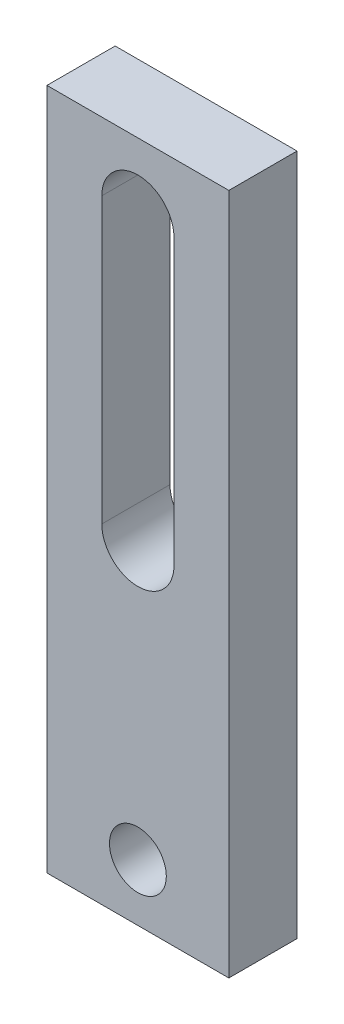
ISO-10303-21;
HEADER;
FILE_DESCRIPTION(('STEP AP214'),'2;1');
FILE_NAME('part.step','',(''),(''),'','','');
FILE_SCHEMA(('AUTOMOTIVE_DESIGN { 1 0 10303 214 1 1 1 1 }'));
ENDSEC;
DATA;
#1=APPLICATION_CONTEXT('core data for automotive mechanical design processes');
#2=APPLICATION_PROTOCOL_DEFINITION('international standard','automotive_design',2000,#1);
#3=PRODUCT_CONTEXT('',#1,'mechanical');
#4=PRODUCT('Part','Part','',(#3));
#5=PRODUCT_RELATED_PRODUCT_CATEGORY('part','',(#4));
#6=PRODUCT_DEFINITION_FORMATION('','',#4);
#7=PRODUCT_DEFINITION_CONTEXT('part definition',#1,'design');
#8=PRODUCT_DEFINITION('design','',#6,#7);
#9=PRODUCT_DEFINITION_SHAPE('','',#8);
#10=(LENGTH_UNIT() NAMED_UNIT(*) SI_UNIT(.MILLI.,.METRE.));
#11=(NAMED_UNIT(*) PLANE_ANGLE_UNIT() SI_UNIT($,.RADIAN.));
#12=(NAMED_UNIT(*) SI_UNIT($,.STERADIAN.) SOLID_ANGLE_UNIT());
#13=UNCERTAINTY_MEASURE_WITH_UNIT(LENGTH_MEASURE(1.E-05),#10,'distance_accuracy_value','');
#14=(GEOMETRIC_REPRESENTATION_CONTEXT(3) GLOBAL_UNCERTAINTY_ASSIGNED_CONTEXT((#13)) GLOBAL_UNIT_ASSIGNED_CONTEXT((#10,
#11,#12)) REPRESENTATION_CONTEXT('',''));
#15=CARTESIAN_POINT('',(0.,0.,0.));
#16=DIRECTION('',(0.,0.,1.));
#17=DIRECTION('',(1.,0.,0.));
#18=AXIS2_PLACEMENT_3D('',#15,#16,#17);
#19=CARTESIAN_POINT('',(-22.1170040672953,0.,3.));
#20=DIRECTION('',(1.,0.,0.));
#21=DIRECTION('',(0.,0.,-1.));
#22=AXIS2_PLACEMENT_3D('',#19,#20,#21);
#23=PLANE('',#22);
#24=DIRECTION('',(0.,-1.,0.));
#25=VECTOR('',#24,1.);
#26=CARTESIAN_POINT('',(-22.1170040672953,0.,0.));
#27=LINE('',#26,#25);
#28=CARTESIAN_POINT('',(-22.1170040672953,30.,0.));
#29=VERTEX_POINT('',#28);
#30=CARTESIAN_POINT('',(-22.1170040672953,0.,0.));
#31=VERTEX_POINT('',#30);
#32=EDGE_CURVE('E137',#29,#31,#27,.T.);
#33=ORIENTED_EDGE('',*,*,#32,.T.);
#34=DIRECTION('',(0.,0.,-1.));
#35=VECTOR('',#34,1.);
#36=CARTESIAN_POINT('',(-22.1170040672953,0.,3.));
#37=LINE('',#36,#35);
#38=CARTESIAN_POINT('',(-22.1170040672953,0.,3.));
#39=VERTEX_POINT('',#38);
#40=EDGE_CURVE('E11',#39,#31,#37,.T.);
#41=ORIENTED_EDGE('',*,*,#40,.F.);
#42=DIRECTION('',(0.,-1.,0.));
#43=VECTOR('',#42,1.);
#44=CARTESIAN_POINT('',(-22.1170040672953,0.,3.));
#45=LINE('',#44,#43);
#46=CARTESIAN_POINT('',(-22.1170040672953,30.,3.));
#47=VERTEX_POINT('',#46);
#48=EDGE_CURVE('E140',#47,#39,#45,.T.);
#49=ORIENTED_EDGE('',*,*,#48,.F.);
#50=DIRECTION('',(0.,0.,-1.));
#51=VECTOR('',#50,1.);
#52=CARTESIAN_POINT('',(-22.1170040672953,30.,3.));
#53=LINE('',#52,#51);
#54=EDGE_CURVE('E150',#47,#29,#53,.T.);
#55=ORIENTED_EDGE('',*,*,#54,.T.);
#56=EDGE_LOOP('',(#33,#41,#49,#55));
#57=FACE_BOUND('',#56,.T.);
#58=ADVANCED_FACE('F33',(#57),#23,.F.);
#59=CARTESIAN_POINT('',(-22.1170040672953,0.,3.));
#60=DIRECTION('',(0.,1.,0.));
#61=DIRECTION('',(0.,0.,1.));
#62=AXIS2_PLACEMENT_3D('',#59,#60,#61);
#63=PLANE('',#62);
#64=DIRECTION('',(1.,0.,0.));
#65=VECTOR('',#64,1.);
#66=CARTESIAN_POINT('',(-22.1170040672953,0.,0.));
#67=LINE('',#66,#65);
#68=CARTESIAN_POINT('',(-14.1170040672953,0.,0.));
#69=VERTEX_POINT('',#68);
#70=EDGE_CURVE('E153',#31,#69,#67,.T.);
#71=ORIENTED_EDGE('',*,*,#70,.T.);
#72=DIRECTION('',(0.,0.,-1.));
#73=VECTOR('',#72,1.);
#74=CARTESIAN_POINT('',(-14.1170040672953,0.,3.));
#75=LINE('',#74,#73);
#76=CARTESIAN_POINT('',(-14.1170040672953,0.,3.));
#77=VERTEX_POINT('',#76);
#78=EDGE_CURVE('E40',#77,#69,#75,.T.);
#79=ORIENTED_EDGE('',*,*,#78,.F.);
#80=DIRECTION('',(1.,0.,0.));
#81=VECTOR('',#80,1.);
#82=CARTESIAN_POINT('',(-22.1170040672953,0.,3.));
#83=LINE('',#82,#81);
#84=EDGE_CURVE('E143',#39,#77,#83,.T.);
#85=ORIENTED_EDGE('',*,*,#84,.F.);
#86=ORIENTED_EDGE('',*,*,#40,.T.);
#87=EDGE_LOOP('',(#71,#79,#85,#86));
#88=FACE_BOUND('',#87,.T.);
#89=ADVANCED_FACE('F182',(#88),#63,.F.);
#90=CARTESIAN_POINT('',(-14.1170040672953,0.,3.));
#91=DIRECTION('',(-1.,0.,0.));
#92=DIRECTION('',(0.,0.,1.));
#93=AXIS2_PLACEMENT_3D('',#90,#91,#92);
#94=PLANE('',#93);
#95=DIRECTION('',(0.,1.,0.));
#96=VECTOR('',#95,1.);
#97=CARTESIAN_POINT('',(-14.1170040672953,0.,0.));
#98=LINE('',#97,#96);
#99=CARTESIAN_POINT('',(-14.1170040672953,30.,0.));
#100=VERTEX_POINT('',#99);
#101=EDGE_CURVE('E155',#69,#100,#98,.T.);
#102=ORIENTED_EDGE('',*,*,#101,.T.);
#103=DIRECTION('',(0.,0.,-1.));
#104=VECTOR('',#103,1.);
#105=CARTESIAN_POINT('',(-14.1170040672953,30.,3.));
#106=LINE('',#105,#104);
#107=CARTESIAN_POINT('',(-14.1170040672953,30.,3.));
#108=VERTEX_POINT('',#107);
#109=EDGE_CURVE('E160',#108,#100,#106,.T.);
#110=ORIENTED_EDGE('',*,*,#109,.F.);
#111=DIRECTION('',(0.,1.,0.));
#112=VECTOR('',#111,1.);
#113=CARTESIAN_POINT('',(-14.1170040672953,0.,3.));
#114=LINE('',#113,#112);
#115=EDGE_CURVE('E146',#77,#108,#114,.T.);
#116=ORIENTED_EDGE('',*,*,#115,.F.);
#117=ORIENTED_EDGE('',*,*,#78,.T.);
#118=EDGE_LOOP('',(#102,#110,#116,#117));
#119=FACE_BOUND('',#118,.T.);
#120=ADVANCED_FACE('F167',(#119),#94,.F.);
#121=CARTESIAN_POINT('',(-22.1170040672953,30.,3.));
#122=DIRECTION('',(0.,-1.,0.));
#123=DIRECTION('',(0.,0.,-1.));
#124=AXIS2_PLACEMENT_3D('',#121,#122,#123);
#125=PLANE('',#124);
#126=DIRECTION('',(-1.,0.,0.));
#127=VECTOR('',#126,1.);
#128=CARTESIAN_POINT('',(-22.1170040672953,30.,0.));
#129=LINE('',#128,#127);
#130=EDGE_CURVE('E144',#100,#29,#129,.T.);
#131=ORIENTED_EDGE('',*,*,#130,.T.);
#132=ORIENTED_EDGE('',*,*,#54,.F.);
#133=DIRECTION('',(-1.,0.,0.));
#134=VECTOR('',#133,1.);
#135=CARTESIAN_POINT('',(-22.1170040672953,30.,3.));
#136=LINE('',#135,#134);
#137=EDGE_CURVE('E148',#108,#47,#136,.T.);
#138=ORIENTED_EDGE('',*,*,#137,.F.);
#139=ORIENTED_EDGE('',*,*,#109,.T.);
#140=EDGE_LOOP('',(#131,#132,#138,#139));
#141=FACE_BOUND('',#140,.T.);
#142=ADVANCED_FACE('F175',(#141),#125,.F.);
#143=CARTESIAN_POINT('',(0.,0.,3.));
#144=DIRECTION('',(0.,0.,-1.));
#145=DIRECTION('',(-1.,0.,0.));
#146=AXIS2_PLACEMENT_3D('',#143,#144,#145);
#147=PLANE('',#146);
#148=DIRECTION('',(0.,-1.,0.));
#149=VECTOR('',#148,1.);
#150=CARTESIAN_POINT('',(-19.7045040672953,27.,3.));
#151=LINE('',#150,#149);
#152=CARTESIAN_POINT('',(-19.7045040672953,27.,3.));
#153=VERTEX_POINT('',#152);
#154=CARTESIAN_POINT('',(-19.7045040672953,14.5,3.));
#155=VERTEX_POINT('',#154);
#156=EDGE_CURVE('E124',#153,#155,#151,.T.);
#157=ORIENTED_EDGE('',*,*,#156,.F.);
#158=CARTESIAN_POINT('',(-18.1170040672953,27.,3.));
#159=DIRECTION('',(0.,0.,1.));
#160=DIRECTION('',(-1.,0.,0.));
#161=AXIS2_PLACEMENT_3D('',#158,#159,#160);
#162=CIRCLE('',#161,1.5875);
#163=CARTESIAN_POINT('',(-16.5295040672953,27.,3.));
#164=VERTEX_POINT('',#163);
#165=EDGE_CURVE('E47',#164,#153,#162,.T.);
#166=ORIENTED_EDGE('',*,*,#165,.F.);
#167=DIRECTION('',(0.,1.,0.));
#168=VECTOR('',#167,1.);
#169=CARTESIAN_POINT('',(-16.5295040672953,27.,3.));
#170=LINE('',#169,#168);
#171=CARTESIAN_POINT('',(-16.5295040672953,14.5,3.));
#172=VERTEX_POINT('',#171);
#173=EDGE_CURVE('E115',#172,#164,#170,.T.);
#174=ORIENTED_EDGE('',*,*,#173,.F.);
#175=CARTESIAN_POINT('',(-18.1170040672953,14.5,3.));
#176=DIRECTION('',(0.,0.,1.));
#177=DIRECTION('',(1.,0.,0.));
#178=AXIS2_PLACEMENT_3D('',#175,#176,#177);
#179=CIRCLE('',#178,1.5875);
#180=EDGE_CURVE('E118',#155,#172,#179,.T.);
#181=ORIENTED_EDGE('',*,*,#180,.F.);
#182=EDGE_LOOP('',(#157,#166,#174,#181));
#183=FACE_BOUND('',#182,.T.);
#184=CARTESIAN_POINT('',(-18.1170040672953,2.5,3.));
#185=DIRECTION('',(0.,0.,1.));
#186=DIRECTION('',(1.,0.,0.));
#187=AXIS2_PLACEMENT_3D('',#184,#185,#186);
#188=CIRCLE('',#187,1.25);
#189=CARTESIAN_POINT('',(-16.8670040672953,2.5,3.));
#190=VERTEX_POINT('',#189);
#191=EDGE_CURVE('E130',#190,#190,#188,.T.);
#192=ORIENTED_EDGE('',*,*,#191,.F.);
#193=EDGE_LOOP('',(#192));
#194=FACE_BOUND('',#193,.T.);
#195=ORIENTED_EDGE('',*,*,#48,.T.);
#196=ORIENTED_EDGE('',*,*,#84,.T.);
#197=ORIENTED_EDGE('',*,*,#115,.T.);
#198=ORIENTED_EDGE('',*,*,#137,.T.);
#199=EDGE_LOOP('',(#195,#196,#197,#198));
#200=FACE_BOUND('',#199,.T.);
#201=ADVANCED_FACE('F181',(#183,#194,#200),#147,.F.);
#202=CARTESIAN_POINT('',(0.,0.,0.));
#203=DIRECTION('',(0.,0.,-1.));
#204=DIRECTION('',(-1.,0.,0.));
#205=AXIS2_PLACEMENT_3D('',#202,#203,#204);
#206=PLANE('',#205);
#207=CARTESIAN_POINT('',(-18.1170040672953,27.,0.));
#208=DIRECTION('',(0.,0.,1.));
#209=DIRECTION('',(-1.,0.,0.));
#210=AXIS2_PLACEMENT_3D('',#207,#208,#209);
#211=CIRCLE('',#210,1.5875);
#212=CARTESIAN_POINT('',(-16.5295040672953,27.,0.));
#213=VERTEX_POINT('',#212);
#214=CARTESIAN_POINT('',(-19.7045040672953,27.,0.));
#215=VERTEX_POINT('',#214);
#216=EDGE_CURVE('E99',#213,#215,#211,.T.);
#217=ORIENTED_EDGE('',*,*,#216,.T.);
#218=DIRECTION('',(0.,-1.,0.));
#219=VECTOR('',#218,1.);
#220=CARTESIAN_POINT('',(-19.7045040672953,27.,0.));
#221=LINE('',#220,#219);
#222=CARTESIAN_POINT('',(-19.7045040672953,14.5,0.));
#223=VERTEX_POINT('',#222);
#224=EDGE_CURVE('E108',#215,#223,#221,.T.);
#225=ORIENTED_EDGE('',*,*,#224,.T.);
#226=CARTESIAN_POINT('',(-18.1170040672953,14.5,0.));
#227=DIRECTION('',(0.,0.,1.));
#228=DIRECTION('',(1.,0.,0.));
#229=AXIS2_PLACEMENT_3D('',#226,#227,#228);
#230=CIRCLE('',#229,1.5875);
#231=CARTESIAN_POINT('',(-16.5295040672953,14.5,0.));
#232=VERTEX_POINT('',#231);
#233=EDGE_CURVE('E55',#223,#232,#230,.T.);
#234=ORIENTED_EDGE('',*,*,#233,.T.);
#235=DIRECTION('',(0.,1.,0.));
#236=VECTOR('',#235,1.);
#237=CARTESIAN_POINT('',(-16.5295040672953,27.,0.));
#238=LINE('',#237,#236);
#239=EDGE_CURVE('E105',#232,#213,#238,.T.);
#240=ORIENTED_EDGE('',*,*,#239,.T.);
#241=EDGE_LOOP('',(#217,#225,#234,#240));
#242=FACE_BOUND('',#241,.T.);
#243=CARTESIAN_POINT('',(-18.1170040672953,2.5,0.));
#244=DIRECTION('',(0.,0.,1.));
#245=DIRECTION('',(1.,0.,0.));
#246=AXIS2_PLACEMENT_3D('',#243,#244,#245);
#247=CIRCLE('',#246,1.25);
#248=CARTESIAN_POINT('',(-16.8670040672953,2.5,0.));
#249=VERTEX_POINT('',#248);
#250=EDGE_CURVE('E134',#249,#249,#247,.T.);
#251=ORIENTED_EDGE('',*,*,#250,.T.);
#252=EDGE_LOOP('',(#251));
#253=FACE_BOUND('',#252,.T.);
#254=ORIENTED_EDGE('',*,*,#32,.F.);
#255=ORIENTED_EDGE('',*,*,#130,.F.);
#256=ORIENTED_EDGE('',*,*,#101,.F.);
#257=ORIENTED_EDGE('',*,*,#70,.F.);
#258=EDGE_LOOP('',(#254,#255,#256,#257));
#259=FACE_BOUND('',#258,.T.);
#260=ADVANCED_FACE('F112',(#242,#253,#259),#206,.T.);
#261=CARTESIAN_POINT('',(-18.1170040672953,2.5,0.));
#262=DIRECTION('',(0.,0.,1.));
#263=DIRECTION('',(1.,0.,0.));
#264=AXIS2_PLACEMENT_3D('',#261,#262,#263);
#265=CYLINDRICAL_SURFACE('',#264,1.25);
#266=ORIENTED_EDGE('',*,*,#250,.F.);
#267=EDGE_LOOP('',(#266));
#268=FACE_BOUND('',#267,.T.);
#269=ORIENTED_EDGE('',*,*,#191,.T.);
#270=EDGE_LOOP('',(#269));
#271=FACE_BOUND('',#270,.T.);
#272=ADVANCED_FACE('F194',(#268,#271),#265,.F.);
#273=CARTESIAN_POINT('',(-18.1170040672953,27.,0.));
#274=DIRECTION('',(0.,0.,1.));
#275=DIRECTION('',(1.,0.,0.));
#276=AXIS2_PLACEMENT_3D('',#273,#274,#275);
#277=CYLINDRICAL_SURFACE('',#276,1.5875);
#278=ORIENTED_EDGE('',*,*,#165,.T.);
#279=DIRECTION('',(0.,0.,1.));
#280=VECTOR('',#279,1.);
#281=CARTESIAN_POINT('',(-19.7045040672953,27.,0.));
#282=LINE('',#281,#280);
#283=EDGE_CURVE('E95',#215,#153,#282,.T.);
#284=ORIENTED_EDGE('',*,*,#283,.F.);
#285=ORIENTED_EDGE('',*,*,#216,.F.);
#286=DIRECTION('',(0.,0.,1.));
#287=VECTOR('',#286,1.);
#288=CARTESIAN_POINT('',(-16.5295040672953,27.,0.));
#289=LINE('',#288,#287);
#290=EDGE_CURVE('E128',#213,#164,#289,.T.);
#291=ORIENTED_EDGE('',*,*,#290,.T.);
#292=EDGE_LOOP('',(#278,#284,#285,#291));
#293=FACE_BOUND('',#292,.T.);
#294=ADVANCED_FACE('F97',(#293),#277,.F.);
#295=CARTESIAN_POINT('',(-16.5295040672953,27.,0.));
#296=DIRECTION('',(1.,0.,0.));
#297=DIRECTION('',(0.,0.,-1.));
#298=AXIS2_PLACEMENT_3D('',#295,#296,#297);
#299=PLANE('',#298);
#300=ORIENTED_EDGE('',*,*,#173,.T.);
#301=ORIENTED_EDGE('',*,*,#290,.F.);
#302=ORIENTED_EDGE('',*,*,#239,.F.);
#303=DIRECTION('',(0.,0.,1.));
#304=VECTOR('',#303,1.);
#305=CARTESIAN_POINT('',(-16.5295040672953,14.5,0.));
#306=LINE('',#305,#304);
#307=EDGE_CURVE('E131',#232,#172,#306,.T.);
#308=ORIENTED_EDGE('',*,*,#307,.T.);
#309=EDGE_LOOP('',(#300,#301,#302,#308));
#310=FACE_BOUND('',#309,.T.);
#311=ADVANCED_FACE('F203',(#310),#299,.F.);
#312=CARTESIAN_POINT('',(-18.1170040672953,14.5,0.));
#313=DIRECTION('',(0.,0.,1.));
#314=DIRECTION('',(1.,0.,0.));
#315=AXIS2_PLACEMENT_3D('',#312,#313,#314);
#316=CYLINDRICAL_SURFACE('',#315,1.5875);
#317=ORIENTED_EDGE('',*,*,#180,.T.);
#318=ORIENTED_EDGE('',*,*,#307,.F.);
#319=ORIENTED_EDGE('',*,*,#233,.F.);
#320=DIRECTION('',(0.,0.,1.));
#321=VECTOR('',#320,1.);
#322=CARTESIAN_POINT('',(-19.7045040672953,14.5,0.));
#323=LINE('',#322,#321);
#324=EDGE_CURVE('E104',#223,#155,#323,.T.);
#325=ORIENTED_EDGE('',*,*,#324,.T.);
#326=EDGE_LOOP('',(#317,#318,#319,#325));
#327=FACE_BOUND('',#326,.T.);
#328=ADVANCED_FACE('F206',(#327),#316,.F.);
#329=CARTESIAN_POINT('',(-19.7045040672953,27.,0.));
#330=DIRECTION('',(-1.,0.,0.));
#331=DIRECTION('',(0.,-1.,0.));
#332=AXIS2_PLACEMENT_3D('',#329,#330,#331);
#333=PLANE('',#332);
#334=ORIENTED_EDGE('',*,*,#156,.T.);
#335=ORIENTED_EDGE('',*,*,#324,.F.);
#336=ORIENTED_EDGE('',*,*,#224,.F.);
#337=ORIENTED_EDGE('',*,*,#283,.T.);
#338=EDGE_LOOP('',(#334,#335,#336,#337));
#339=FACE_BOUND('',#338,.T.);
#340=ADVANCED_FACE('F109',(#339),#333,.F.);
#341=CLOSED_SHELL('',(#58,#89,#120,#142,#201,#260,#272,#294,#311,#328,#340));
#342=MANIFOLD_SOLID_BREP('B2',#341);
#343=ADVANCED_BREP_SHAPE_REPRESENTATION('',(#18,#342),#14);
#344=SHAPE_DEFINITION_REPRESENTATION(#9,#343);
ENDSEC;
END-ISO-10303-21;
